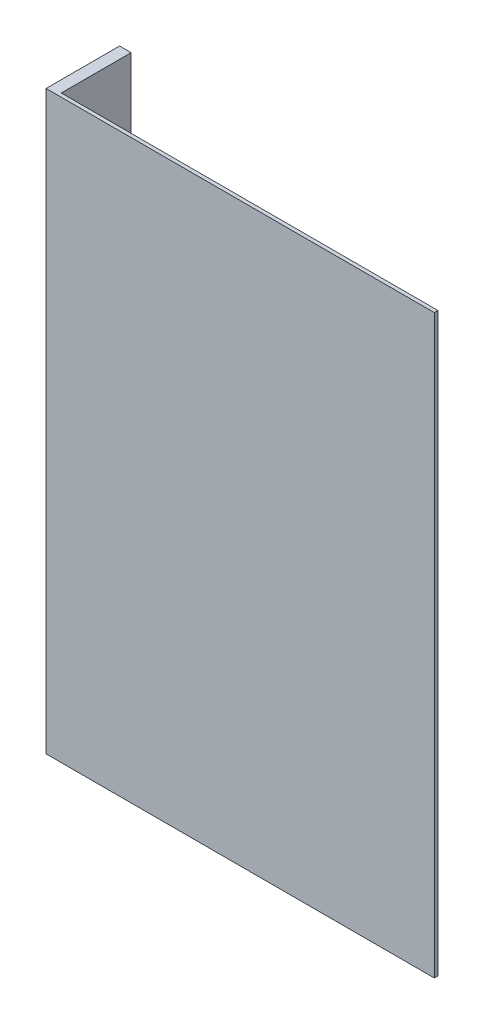
ISO-10303-21;
HEADER;
FILE_DESCRIPTION(('STEP AP214'),'2;1');
FILE_NAME('part.step','',(''),(''),'','','');
FILE_SCHEMA(('AUTOMOTIVE_DESIGN { 1 0 10303 214 1 1 1 1 }'));
ENDSEC;
DATA;
#1=APPLICATION_CONTEXT('core data for automotive mechanical design processes');
#2=APPLICATION_PROTOCOL_DEFINITION('international standard','automotive_design',2000,#1);
#3=PRODUCT_CONTEXT('',#1,'mechanical');
#4=PRODUCT('Part','Part','',(#3));
#5=PRODUCT_RELATED_PRODUCT_CATEGORY('part','',(#4));
#6=PRODUCT_DEFINITION_FORMATION('','',#4);
#7=PRODUCT_DEFINITION_CONTEXT('part definition',#1,'design');
#8=PRODUCT_DEFINITION('design','',#6,#7);
#9=PRODUCT_DEFINITION_SHAPE('','',#8);
#10=(LENGTH_UNIT() NAMED_UNIT(*) SI_UNIT(.MILLI.,.METRE.));
#11=(NAMED_UNIT(*) PLANE_ANGLE_UNIT() SI_UNIT($,.RADIAN.));
#12=(NAMED_UNIT(*) SI_UNIT($,.STERADIAN.) SOLID_ANGLE_UNIT());
#13=UNCERTAINTY_MEASURE_WITH_UNIT(LENGTH_MEASURE(1.E-05),#10,'distance_accuracy_value','');
#14=(GEOMETRIC_REPRESENTATION_CONTEXT(3) GLOBAL_UNCERTAINTY_ASSIGNED_CONTEXT((#13)) GLOBAL_UNIT_ASSIGNED_CONTEXT((#10,
#11,#12)) REPRESENTATION_CONTEXT('',''));
#15=CARTESIAN_POINT('',(0.,0.,0.));
#16=DIRECTION('',(0.,0.,1.));
#17=DIRECTION('',(1.,0.,0.));
#18=AXIS2_PLACEMENT_3D('',#15,#16,#17);
#19=CARTESIAN_POINT('',(0.,0.,0.));
#20=DIRECTION('',(0.,0.,1.));
#21=DIRECTION('',(1.,0.,0.));
#22=AXIS2_PLACEMENT_3D('',#19,#20,#21);
#23=PLANE('',#22);
#24=DIRECTION('',(0.,-1.,0.));
#25=VECTOR('',#24,1.);
#26=CARTESIAN_POINT('',(-80.4142304845409,-124.46,0.));
#27=LINE('',#26,#25);
#28=CARTESIAN_POINT('',(-80.4142304845409,2.54000000000001,0.));
#29=VERTEX_POINT('',#28);
#30=CARTESIAN_POINT('',(-80.4142304845409,-124.46,0.));
#31=VERTEX_POINT('',#30);
#32=EDGE_CURVE('E52',#29,#31,#27,.T.);
#33=ORIENTED_EDGE('',*,*,#32,.F.);
#34=DIRECTION('',(-1.,0.,0.));
#35=VECTOR('',#34,1.);
#36=CARTESIAN_POINT('',(2.59167900320902,2.54000000000001,0.));
#37=LINE('',#36,#35);
#38=CARTESIAN_POINT('',(2.59167900320902,2.54000000000001,0.));
#39=VERTEX_POINT('',#38);
#40=EDGE_CURVE('E83',#39,#29,#37,.T.);
#41=ORIENTED_EDGE('',*,*,#40,.F.);
#42=DIRECTION('',(0.,1.,0.));
#43=VECTOR('',#42,1.);
#44=CARTESIAN_POINT('',(2.59167900320902,2.54000000000001,0.));
#45=LINE('',#44,#43);
#46=CARTESIAN_POINT('',(2.59167900320902,-124.46,0.));
#47=VERTEX_POINT('',#46);
#48=EDGE_CURVE('E73',#47,#39,#45,.T.);
#49=ORIENTED_EDGE('',*,*,#48,.F.);
#50=DIRECTION('',(1.,0.,0.));
#51=VECTOR('',#50,1.);
#52=CARTESIAN_POINT('',(-72.4142304845409,-124.46,0.));
#53=LINE('',#52,#51);
#54=EDGE_CURVE('E79',#31,#47,#53,.T.);
#55=ORIENTED_EDGE('',*,*,#54,.F.);
#56=EDGE_LOOP('',(#33,#41,#49,#55));
#57=FACE_BOUND('',#56,.T.);
#58=ADVANCED_FACE('F37',(#57),#23,.F.);
#59=CARTESIAN_POINT('',(2.59167900320902,2.54000000000001,0.8));
#60=DIRECTION('',(0.,-1.,0.));
#61=DIRECTION('',(0.,0.,-1.));
#62=AXIS2_PLACEMENT_3D('',#59,#60,#61);
#63=PLANE('',#62);
#64=ORIENTED_EDGE('',*,*,#40,.T.);
#65=DIRECTION('',(0.,0.,1.));
#66=VECTOR('',#65,1.);
#67=CARTESIAN_POINT('',(-80.4142304845409,2.54000000000001,-142.425397460514));
#68=LINE('',#67,#66);
#69=CARTESIAN_POINT('',(-80.4142304845409,2.54000000000001,-15.4000000000062));
#70=VERTEX_POINT('',#69);
#71=EDGE_CURVE('E107',#70,#29,#68,.T.);
#72=ORIENTED_EDGE('',*,*,#71,.F.);
#73=DIRECTION('',(1.,0.,0.));
#74=VECTOR('',#73,1.);
#75=CARTESIAN_POINT('',(-82.9542304845492,2.54000000000001,-15.4000000000064));
#76=LINE('',#75,#74);
#77=CARTESIAN_POINT('',(-82.9542304845397,2.54000000000001,-15.4000000000064));
#78=VERTEX_POINT('',#77);
#79=EDGE_CURVE('E111',#78,#70,#76,.T.);
#80=ORIENTED_EDGE('',*,*,#79,.F.);
#81=DIRECTION('',(0.,0.,-1.));
#82=VECTOR('',#81,1.);
#83=CARTESIAN_POINT('',(-82.9542304845397,2.54000000000001,0.8));
#84=LINE('',#83,#82);
#85=CARTESIAN_POINT('',(-82.9542304845397,2.54000000000001,0.8));
#86=VERTEX_POINT('',#85);
#87=EDGE_CURVE('E86',#86,#78,#84,.T.);
#88=ORIENTED_EDGE('',*,*,#87,.F.);
#89=DIRECTION('',(-1.,0.,0.));
#90=VECTOR('',#89,1.);
#91=CARTESIAN_POINT('',(2.59167900320902,2.54000000000001,0.8));
#92=LINE('',#91,#90);
#93=CARTESIAN_POINT('',(2.59167900320902,2.54000000000001,0.8));
#94=VERTEX_POINT('',#93);
#95=EDGE_CURVE('E78',#94,#86,#92,.T.);
#96=ORIENTED_EDGE('',*,*,#95,.F.);
#97=DIRECTION('',(0.,0.,-1.));
#98=VECTOR('',#97,1.);
#99=CARTESIAN_POINT('',(2.59167900320902,2.54000000000001,0.8));
#100=LINE('',#99,#98);
#101=EDGE_CURVE('E45',#94,#39,#100,.T.);
#102=ORIENTED_EDGE('',*,*,#101,.T.);
#103=EDGE_LOOP('',(#64,#72,#80,#88,#96,#102));
#104=FACE_BOUND('',#103,.T.);
#105=ADVANCED_FACE('F39',(#104),#63,.F.);
#106=CARTESIAN_POINT('',(-72.4142304845409,-124.46,0.8));
#107=DIRECTION('',(0.,1.,0.));
#108=DIRECTION('',(0.,0.,1.));
#109=AXIS2_PLACEMENT_3D('',#106,#107,#108);
#110=PLANE('',#109);
#111=DIRECTION('',(0.,0.,-1.));
#112=VECTOR('',#111,1.);
#113=CARTESIAN_POINT('',(-82.9542304845397,-124.46,0.8));
#114=LINE('',#113,#112);
#115=CARTESIAN_POINT('',(-82.9542304845397,-124.46,0.8));
#116=VERTEX_POINT('',#115);
#117=CARTESIAN_POINT('',(-82.9542304845397,-124.46,-15.4000000000064));
#118=VERTEX_POINT('',#117);
#119=EDGE_CURVE('E90',#116,#118,#114,.T.);
#120=ORIENTED_EDGE('',*,*,#119,.T.);
#121=DIRECTION('',(-1.,0.,0.));
#122=VECTOR('',#121,1.);
#123=CARTESIAN_POINT('',(-82.9542304845492,-124.46,-15.4000000000064));
#124=LINE('',#123,#122);
#125=CARTESIAN_POINT('',(-80.4142304845409,-124.46,-15.4000000000063));
#126=VERTEX_POINT('',#125);
#127=EDGE_CURVE('E102',#126,#118,#124,.T.);
#128=ORIENTED_EDGE('',*,*,#127,.F.);
#129=DIRECTION('',(0.,0.,1.));
#130=VECTOR('',#129,1.);
#131=CARTESIAN_POINT('',(-80.4142304845409,-124.46,-142.425397460514));
#132=LINE('',#131,#130);
#133=EDGE_CURVE('E103',#126,#31,#132,.T.);
#134=ORIENTED_EDGE('',*,*,#133,.T.);
#135=ORIENTED_EDGE('',*,*,#54,.T.);
#136=DIRECTION('',(0.,0.,-1.));
#137=VECTOR('',#136,1.);
#138=CARTESIAN_POINT('',(2.59167900320902,-124.46,0.8));
#139=LINE('',#138,#137);
#140=CARTESIAN_POINT('',(2.59167900320902,-124.46,0.8));
#141=VERTEX_POINT('',#140);
#142=EDGE_CURVE('E11',#141,#47,#139,.T.);
#143=ORIENTED_EDGE('',*,*,#142,.F.);
#144=DIRECTION('',(1.,0.,0.));
#145=VECTOR('',#144,1.);
#146=CARTESIAN_POINT('',(-72.4142304845409,-124.46,0.8));
#147=LINE('',#146,#145);
#148=EDGE_CURVE('E94',#116,#141,#147,.T.);
#149=ORIENTED_EDGE('',*,*,#148,.F.);
#150=EDGE_LOOP('',(#120,#128,#134,#135,#143,#149));
#151=FACE_BOUND('',#150,.T.);
#152=ADVANCED_FACE('F138',(#151),#110,.F.);
#153=CARTESIAN_POINT('',(2.59167900320902,2.54000000000001,0.8));
#154=DIRECTION('',(-1.,0.,0.));
#155=DIRECTION('',(0.,0.,1.));
#156=AXIS2_PLACEMENT_3D('',#153,#154,#155);
#157=PLANE('',#156);
#158=ORIENTED_EDGE('',*,*,#48,.T.);
#159=ORIENTED_EDGE('',*,*,#101,.F.);
#160=DIRECTION('',(0.,1.,0.));
#161=VECTOR('',#160,1.);
#162=CARTESIAN_POINT('',(2.59167900320902,2.54000000000001,0.8));
#163=LINE('',#162,#161);
#164=EDGE_CURVE('E61',#141,#94,#163,.T.);
#165=ORIENTED_EDGE('',*,*,#164,.F.);
#166=ORIENTED_EDGE('',*,*,#142,.T.);
#167=EDGE_LOOP('',(#158,#159,#165,#166));
#168=FACE_BOUND('',#167,.T.);
#169=ADVANCED_FACE('F75',(#168),#157,.F.);
#170=CARTESIAN_POINT('',(0.,0.,0.8));
#171=DIRECTION('',(0.,0.,1.));
#172=DIRECTION('',(1.,0.,0.));
#173=AXIS2_PLACEMENT_3D('',#170,#171,#172);
#174=PLANE('',#173);
#175=ORIENTED_EDGE('',*,*,#95,.T.);
#176=DIRECTION('',(0.,-1.,0.));
#177=VECTOR('',#176,1.);
#178=CARTESIAN_POINT('',(-82.9542304845397,2.54000000000001,0.8));
#179=LINE('',#178,#177);
#180=EDGE_CURVE('E99',#86,#116,#179,.T.);
#181=ORIENTED_EDGE('',*,*,#180,.T.);
#182=ORIENTED_EDGE('',*,*,#148,.T.);
#183=ORIENTED_EDGE('',*,*,#164,.T.);
#184=EDGE_LOOP('',(#175,#181,#182,#183));
#185=FACE_BOUND('',#184,.T.);
#186=ADVANCED_FACE('F142',(#185),#174,.T.);
#187=CARTESIAN_POINT('',(-82.9542304845397,-124.46,0.8));
#188=DIRECTION('',(1.,0.,0.));
#189=DIRECTION('',(0.,0.,-1.));
#190=AXIS2_PLACEMENT_3D('',#187,#188,#189);
#191=PLANE('',#190);
#192=ORIENTED_EDGE('',*,*,#87,.T.);
#193=DIRECTION('',(0.,1.,0.));
#194=VECTOR('',#193,1.);
#195=CARTESIAN_POINT('',(-82.9542304845397,-9.46000000000002,-15.4000000000064));
#196=LINE('',#195,#194);
#197=EDGE_CURVE('E106',#118,#78,#196,.T.);
#198=ORIENTED_EDGE('',*,*,#197,.F.);
#199=ORIENTED_EDGE('',*,*,#119,.F.);
#200=ORIENTED_EDGE('',*,*,#180,.F.);
#201=EDGE_LOOP('',(#192,#198,#199,#200));
#202=FACE_BOUND('',#201,.T.);
#203=ADVANCED_FACE('F144',(#202),#191,.F.);
#204=CARTESIAN_POINT('',(-80.4142304845409,-124.46,-142.425397460514));
#205=DIRECTION('',(-1.,0.,0.));
#206=DIRECTION('',(0.,0.,1.));
#207=AXIS2_PLACEMENT_3D('',#204,#205,#206);
#208=PLANE('',#207);
#209=DIRECTION('',(0.,-1.,0.));
#210=VECTOR('',#209,1.);
#211=CARTESIAN_POINT('',(-80.4142304845409,-124.46,-15.4000000000062));
#212=LINE('',#211,#210);
#213=EDGE_CURVE('E114',#70,#126,#212,.T.);
#214=ORIENTED_EDGE('',*,*,#213,.F.);
#215=ORIENTED_EDGE('',*,*,#71,.T.);
#216=ORIENTED_EDGE('',*,*,#32,.T.);
#217=ORIENTED_EDGE('',*,*,#133,.F.);
#218=EDGE_LOOP('',(#214,#215,#216,#217));
#219=FACE_BOUND('',#218,.T.);
#220=ADVANCED_FACE('F123',(#219),#208,.F.);
#221=CARTESIAN_POINT('',(-82.9542304845397,2.54000000000001,-15.4000000000064));
#222=DIRECTION('',(0.,0.,-1.));
#223=DIRECTION('',(1.,0.,0.));
#224=AXIS2_PLACEMENT_3D('',#221,#222,#223);
#225=PLANE('',#224);
#226=ORIENTED_EDGE('',*,*,#197,.T.);
#227=ORIENTED_EDGE('',*,*,#79,.T.);
#228=ORIENTED_EDGE('',*,*,#213,.T.);
#229=ORIENTED_EDGE('',*,*,#127,.T.);
#230=EDGE_LOOP('',(#226,#227,#228,#229));
#231=FACE_BOUND('',#230,.T.);
#232=ADVANCED_FACE('F147',(#231),#225,.T.);
#233=CLOSED_SHELL('',(#58,#105,#152,#169,#186,#203,#220,#232));
#234=MANIFOLD_SOLID_BREP('B2',#233);
#235=ADVANCED_BREP_SHAPE_REPRESENTATION('',(#18,#234),#14);
#236=SHAPE_DEFINITION_REPRESENTATION(#9,#235);
ENDSEC;
END-ISO-10303-21;
